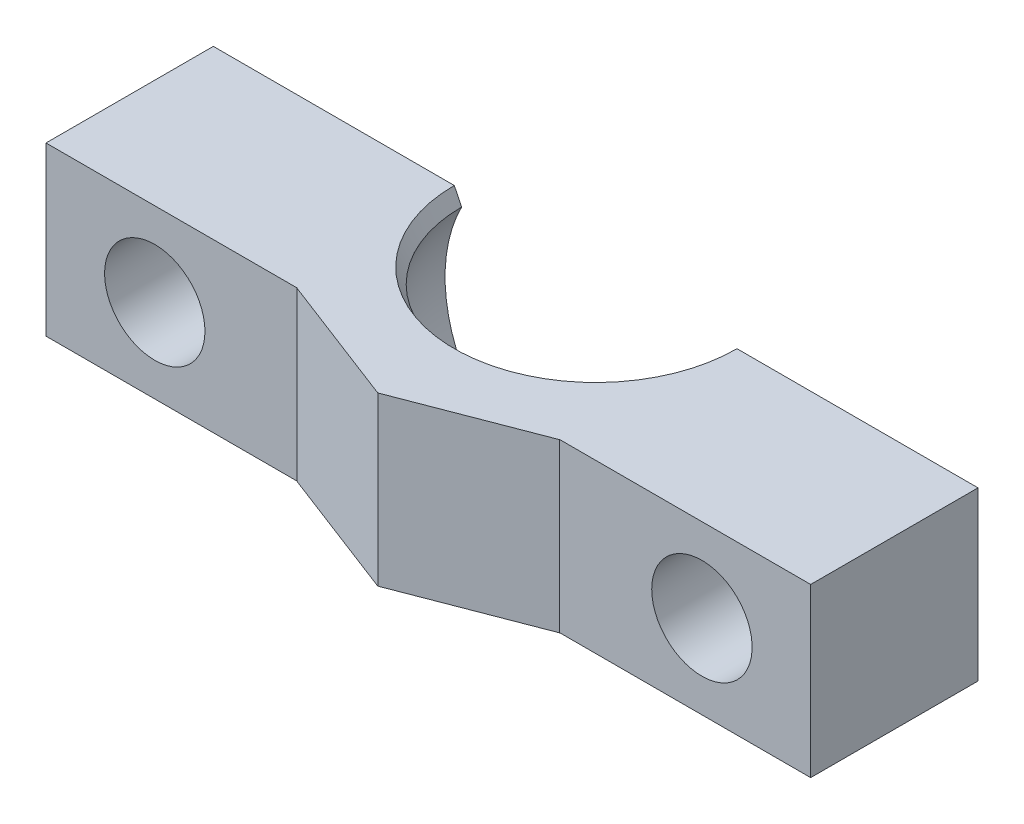
ISO-10303-21;
HEADER;
FILE_DESCRIPTION(('STEP AP214'),'2;1');
FILE_NAME('part.step','',(''),(''),'','','');
FILE_SCHEMA(('AUTOMOTIVE_DESIGN { 1 0 10303 214 1 1 1 1 }'));
ENDSEC;
DATA;
#1=APPLICATION_CONTEXT('core data for automotive mechanical design processes');
#2=APPLICATION_PROTOCOL_DEFINITION('international standard','automotive_design',2000,#1);
#3=PRODUCT_CONTEXT('',#1,'mechanical');
#4=PRODUCT('Part','Part','',(#3));
#5=PRODUCT_RELATED_PRODUCT_CATEGORY('part','',(#4));
#6=PRODUCT_DEFINITION_FORMATION('','',#4);
#7=PRODUCT_DEFINITION_CONTEXT('part definition',#1,'design');
#8=PRODUCT_DEFINITION('design','',#6,#7);
#9=PRODUCT_DEFINITION_SHAPE('','',#8);
#10=(LENGTH_UNIT() NAMED_UNIT(*) SI_UNIT(.MILLI.,.METRE.));
#11=(NAMED_UNIT(*) PLANE_ANGLE_UNIT() SI_UNIT($,.RADIAN.));
#12=(NAMED_UNIT(*) SI_UNIT($,.STERADIAN.) SOLID_ANGLE_UNIT());
#13=UNCERTAINTY_MEASURE_WITH_UNIT(LENGTH_MEASURE(1.E-05),#10,'distance_accuracy_value','');
#14=(GEOMETRIC_REPRESENTATION_CONTEXT(3) GLOBAL_UNCERTAINTY_ASSIGNED_CONTEXT((#13)) GLOBAL_UNIT_ASSIGNED_CONTEXT((#10,
#11,#12)) REPRESENTATION_CONTEXT('',''));
#15=CARTESIAN_POINT('',(0.,0.,0.));
#16=DIRECTION('',(0.,0.,1.));
#17=DIRECTION('',(1.,0.,0.));
#18=AXIS2_PLACEMENT_3D('',#15,#16,#17);
#19=CARTESIAN_POINT('',(-45.7,10.,0.));
#20=DIRECTION('',(1.,0.,0.));
#21=DIRECTION('',(0.,0.,-1.));
#22=AXIS2_PLACEMENT_3D('',#19,#20,#21);
#23=PLANE('',#22);
#24=DIRECTION('',(0.,-1.,0.));
#25=VECTOR('',#24,1.);
#26=CARTESIAN_POINT('',(-45.7,10.,10.));
#27=LINE('',#26,#25);
#28=CARTESIAN_POINT('',(-45.7,10.,10.));
#29=VERTEX_POINT('',#28);
#30=CARTESIAN_POINT('',(-45.7,0.,10.));
#31=VERTEX_POINT('',#30);
#32=EDGE_CURVE('E156',#29,#31,#27,.T.);
#33=ORIENTED_EDGE('',*,*,#32,.F.);
#34=DIRECTION('',(0.,0.,1.));
#35=VECTOR('',#34,1.);
#36=CARTESIAN_POINT('',(-45.7,10.,0.));
#37=LINE('',#36,#35);
#38=CARTESIAN_POINT('',(-45.7,10.,0.));
#39=VERTEX_POINT('',#38);
#40=EDGE_CURVE('E202',#39,#29,#37,.T.);
#41=ORIENTED_EDGE('',*,*,#40,.F.);
#42=DIRECTION('',(0.,-1.,0.));
#43=VECTOR('',#42,1.);
#44=CARTESIAN_POINT('',(-45.7,10.,0.));
#45=LINE('',#44,#43);
#46=CARTESIAN_POINT('',(-45.7,0.,0.));
#47=VERTEX_POINT('',#46);
#48=EDGE_CURVE('E205',#39,#47,#45,.T.);
#49=ORIENTED_EDGE('',*,*,#48,.T.);
#50=DIRECTION('',(0.,0.,1.));
#51=VECTOR('',#50,1.);
#52=CARTESIAN_POINT('',(-45.7,0.,0.));
#53=LINE('',#52,#51);
#54=EDGE_CURVE('E199',#47,#31,#53,.T.);
#55=ORIENTED_EDGE('',*,*,#54,.T.);
#56=EDGE_LOOP('',(#33,#41,#49,#55));
#57=FACE_BOUND('',#56,.T.);
#58=ADVANCED_FACE('F39',(#57),#23,.F.);
#59=CARTESIAN_POINT('',(-39.2,5.,15.));
#60=DIRECTION('',(0.,0.,-1.));
#61=DIRECTION('',(-1.,0.,0.));
#62=AXIS2_PLACEMENT_3D('',#59,#60,#61);
#63=CYLINDRICAL_SURFACE('',#62,3.);
#64=CARTESIAN_POINT('',(-39.2,5.,0.));
#65=DIRECTION('',(0.,0.,-1.));
#66=DIRECTION('',(-1.,0.,0.));
#67=AXIS2_PLACEMENT_3D('',#64,#65,#66);
#68=CIRCLE('',#67,3.);
#69=CARTESIAN_POINT('',(-42.2,5.,0.));
#70=VERTEX_POINT('',#69);
#71=EDGE_CURVE('E188',#70,#70,#68,.T.);
#72=ORIENTED_EDGE('',*,*,#71,.T.);
#73=EDGE_LOOP('',(#72));
#74=FACE_BOUND('',#73,.T.);
#75=CARTESIAN_POINT('',(-39.2,5.,10.));
#76=DIRECTION('',(0.,0.,1.));
#77=DIRECTION('',(1.,0.,0.));
#78=AXIS2_PLACEMENT_3D('',#75,#76,#77);
#79=CIRCLE('',#78,3.);
#80=CARTESIAN_POINT('',(-36.2,5.,10.));
#81=VERTEX_POINT('',#80);
#82=EDGE_CURVE('E191',#81,#81,#79,.F.);
#83=ORIENTED_EDGE('',*,*,#82,.F.);
#84=EDGE_LOOP('',(#83));
#85=FACE_BOUND('',#84,.T.);
#86=ADVANCED_FACE('F270',(#74,#85),#63,.F.);
#87=CARTESIAN_POINT('',(0.,10.,0.));
#88=DIRECTION('',(0.,0.,1.));
#89=DIRECTION('',(1.,0.,0.));
#90=AXIS2_PLACEMENT_3D('',#87,#88,#89);
#91=PLANE('',#90);
#92=ORIENTED_EDGE('',*,*,#71,.F.);
#93=EDGE_LOOP('',(#92));
#94=FACE_BOUND('',#93,.T.);
#95=CARTESIAN_POINT('',(-22.85,5.,0.));
#96=DIRECTION('',(0.,0.,1.));
#97=DIRECTION('',(1.,0.,0.));
#98=AXIS2_PLACEMENT_3D('',#95,#96,#97);
#99=CIRCLE('',#98,9.);
#100=CARTESIAN_POINT('',(-30.8584077140291,9.10675125687925,0.));
#101=VERTEX_POINT('',#100);
#102=CARTESIAN_POINT('',(-30.8584077140291,0.893248743120768,0.));
#103=VERTEX_POINT('',#102);
#104=EDGE_CURVE('E192',#101,#103,#99,.T.);
#105=ORIENTED_EDGE('',*,*,#104,.T.);
#106=DIRECTION('',(-0.442304522045315,-0.896864933966239,0.));
#107=VECTOR('',#106,1.);
#108=CARTESIAN_POINT('',(-22.85,17.1319704781013,0.));
#109=LINE('',#108,#107);
#110=CARTESIAN_POINT('',(-31.2989288487404,0.,0.));
#111=VERTEX_POINT('',#110);
#112=EDGE_CURVE('E241',#103,#111,#109,.T.);
#113=ORIENTED_EDGE('',*,*,#112,.T.);
#114=DIRECTION('',(-1.,0.,0.));
#115=VECTOR('',#114,1.);
#116=CARTESIAN_POINT('',(0.,0.,0.));
#117=LINE('',#116,#115);
#118=EDGE_CURVE('E207',#111,#47,#117,.T.);
#119=ORIENTED_EDGE('',*,*,#118,.T.);
#120=ORIENTED_EDGE('',*,*,#48,.F.);
#121=DIRECTION('',(-1.,0.,0.));
#122=VECTOR('',#121,1.);
#123=CARTESIAN_POINT('',(0.,10.,0.));
#124=LINE('',#123,#122);
#125=CARTESIAN_POINT('',(-31.2989288487404,10.,0.));
#126=VERTEX_POINT('',#125);
#127=EDGE_CURVE('E198',#126,#39,#124,.T.);
#128=ORIENTED_EDGE('',*,*,#127,.F.);
#129=DIRECTION('',(0.442304522045323,-0.896864933966235,0.));
#130=VECTOR('',#129,1.);
#131=CARTESIAN_POINT('',(-22.85,-7.13197047810091,0.));
#132=LINE('',#131,#130);
#133=EDGE_CURVE('E239',#126,#101,#132,.T.);
#134=ORIENTED_EDGE('',*,*,#133,.T.);
#135=EDGE_LOOP('',(#105,#113,#119,#120,#128,#134));
#136=FACE_BOUND('',#135,.T.);
#137=ADVANCED_FACE('F255',(#94,#136),#91,.F.);
#138=CARTESIAN_POINT('',(0.,10.,0.));
#139=DIRECTION('',(-1.,0.,0.));
#140=DIRECTION('',(0.,0.,1.));
#141=AXIS2_PLACEMENT_3D('',#138,#139,#140);
#142=PLANE('',#141);
#143=DIRECTION('',(0.,0.,-1.));
#144=VECTOR('',#143,1.);
#145=CARTESIAN_POINT('',(0.,10.,0.));
#146=LINE('',#145,#144);
#147=CARTESIAN_POINT('',(0.,10.,10.));
#148=VERTEX_POINT('',#147);
#149=CARTESIAN_POINT('',(0.,10.,0.));
#150=VERTEX_POINT('',#149);
#151=EDGE_CURVE('E196',#148,#150,#146,.T.);
#152=ORIENTED_EDGE('',*,*,#151,.F.);
#153=DIRECTION('',(0.,1.,0.));
#154=VECTOR('',#153,1.);
#155=CARTESIAN_POINT('',(0.,10.,10.));
#156=LINE('',#155,#154);
#157=CARTESIAN_POINT('',(0.,0.,10.));
#158=VERTEX_POINT('',#157);
#159=EDGE_CURVE('E168',#158,#148,#156,.T.);
#160=ORIENTED_EDGE('',*,*,#159,.F.);
#161=DIRECTION('',(0.,0.,-1.));
#162=VECTOR('',#161,1.);
#163=CARTESIAN_POINT('',(0.,0.,0.));
#164=LINE('',#163,#162);
#165=CARTESIAN_POINT('',(0.,0.,0.));
#166=VERTEX_POINT('',#165);
#167=EDGE_CURVE('E195',#158,#166,#164,.T.);
#168=ORIENTED_EDGE('',*,*,#167,.T.);
#169=DIRECTION('',(0.,-1.,0.));
#170=VECTOR('',#169,1.);
#171=CARTESIAN_POINT('',(0.,10.,0.));
#172=LINE('',#171,#170);
#173=EDGE_CURVE('E213',#150,#166,#172,.T.);
#174=ORIENTED_EDGE('',*,*,#173,.F.);
#175=EDGE_LOOP('',(#152,#160,#168,#174));
#176=FACE_BOUND('',#175,.T.);
#177=ADVANCED_FACE('F282',(#176),#142,.F.);
#178=CARTESIAN_POINT('',(-6.5,5.,0.));
#179=DIRECTION('',(0.,0.,-1.));
#180=DIRECTION('',(-1.,0.,0.));
#181=AXIS2_PLACEMENT_3D('',#178,#179,#180);
#182=CIRCLE('',#181,3.);
#183=CARTESIAN_POINT('',(-9.5,5.,0.));
#184=VERTEX_POINT('',#183);
#185=EDGE_CURVE('E184',#184,#184,#182,.T.);
#186=ORIENTED_EDGE('',*,*,#185,.F.);
#187=EDGE_LOOP('',(#186));
#188=FACE_BOUND('',#187,.T.);
#189=CARTESIAN_POINT('',(-14.4010711512596,0.,0.));
#190=VERTEX_POINT('',#189);
#191=EDGE_CURVE('E208',#166,#190,#117,.T.);
#192=ORIENTED_EDGE('',*,*,#191,.T.);
#193=DIRECTION('',(-0.442304522045315,0.896864933966239,0.));
#194=VECTOR('',#193,1.);
#195=CARTESIAN_POINT('',(-22.85,17.1319704781013,0.));
#196=LINE('',#195,#194);
#197=CARTESIAN_POINT('',(-14.8415922859709,0.893248743120767,0.));
#198=VERTEX_POINT('',#197);
#199=EDGE_CURVE('E48',#190,#198,#196,.T.);
#200=ORIENTED_EDGE('',*,*,#199,.T.);
#201=CARTESIAN_POINT('',(-14.8415922859709,9.10675125687925,0.));
#202=VERTEX_POINT('',#201);
#203=EDGE_CURVE('E187',#198,#202,#99,.T.);
#204=ORIENTED_EDGE('',*,*,#203,.T.);
#205=DIRECTION('',(0.442304522045323,0.896864933966235,0.));
#206=VECTOR('',#205,1.);
#207=CARTESIAN_POINT('',(-22.85,-7.13197047810091,0.));
#208=LINE('',#207,#206);
#209=CARTESIAN_POINT('',(-14.4010711512596,10.,0.));
#210=VERTEX_POINT('',#209);
#211=EDGE_CURVE('E55',#202,#210,#208,.T.);
#212=ORIENTED_EDGE('',*,*,#211,.T.);
#213=EDGE_CURVE('E200',#150,#210,#124,.T.);
#214=ORIENTED_EDGE('',*,*,#213,.F.);
#215=ORIENTED_EDGE('',*,*,#173,.T.);
#216=EDGE_LOOP('',(#192,#200,#204,#212,#214,#215));
#217=FACE_BOUND('',#216,.T.);
#218=ADVANCED_FACE('F246',(#188,#217),#91,.F.);
#219=CARTESIAN_POINT('',(0.,10.,0.));
#220=DIRECTION('',(0.,-1.,0.));
#221=DIRECTION('',(0.,0.,-1.));
#222=AXIS2_PLACEMENT_3D('',#219,#220,#221);
#223=PLANE('',#222);
#224=ORIENTED_EDGE('',*,*,#213,.T.);
#225=CARTESIAN_POINT('',(-22.85,10.,0.));
#226=DIRECTION('',(0.,-1.,0.));
#227=DIRECTION('',(0.,0.,-1.));
#228=AXIS2_PLACEMENT_3D('',#225,#226,#227);
#229=CIRCLE('',#228,8.44892884874043);
#230=EDGE_CURVE('E11',#210,#126,#229,.T.);
#231=ORIENTED_EDGE('',*,*,#230,.T.);
#232=ORIENTED_EDGE('',*,*,#127,.T.);
#233=ORIENTED_EDGE('',*,*,#40,.T.);
#234=DIRECTION('',(-1.,0.,0.));
#235=VECTOR('',#234,1.);
#236=CARTESIAN_POINT('',(-45.7,10.,10.));
#237=LINE('',#236,#235);
#238=CARTESIAN_POINT('',(-30.7,10.,10.));
#239=VERTEX_POINT('',#238);
#240=EDGE_CURVE('E149',#239,#29,#237,.T.);
#241=ORIENTED_EDGE('',*,*,#240,.F.);
#242=DIRECTION('',(0.,0.,1.));
#243=VECTOR('',#242,1.);
#244=CARTESIAN_POINT('',(-30.7,10.,10.));
#245=LINE('',#244,#243);
#246=CARTESIAN_POINT('',(-30.7,10.,10.0097675445396));
#247=VERTEX_POINT('',#246);
#248=EDGE_CURVE('E146',#239,#247,#245,.T.);
#249=ORIENTED_EDGE('',*,*,#248,.T.);
#250=DIRECTION('',(-0.933580426497202,0.,-0.358367949545299));
#251=VECTOR('',#250,1.);
#252=CARTESIAN_POINT('',(-30.7,10.,10.0097675445396));
#253=LINE('',#252,#251);
#254=CARTESIAN_POINT('',(-22.85,10.,13.0231002195676));
#255=VERTEX_POINT('',#254);
#256=EDGE_CURVE('E226',#247,#255,#253,.F.);
#257=ORIENTED_EDGE('',*,*,#256,.T.);
#258=DIRECTION('',(-0.933580426497202,0.,0.358367949545299));
#259=VECTOR('',#258,1.);
#260=CARTESIAN_POINT('',(-15.,10.,10.0097675445396));
#261=LINE('',#260,#259);
#262=CARTESIAN_POINT('',(-15.,10.,10.0097675445396));
#263=VERTEX_POINT('',#262);
#264=EDGE_CURVE('E228',#255,#263,#261,.F.);
#265=ORIENTED_EDGE('',*,*,#264,.T.);
#266=DIRECTION('',(0.,0.,1.));
#267=VECTOR('',#266,1.);
#268=CARTESIAN_POINT('',(-15.,10.,10.));
#269=LINE('',#268,#267);
#270=CARTESIAN_POINT('',(-15.,10.,10.));
#271=VERTEX_POINT('',#270);
#272=EDGE_CURVE('E178',#271,#263,#269,.T.);
#273=ORIENTED_EDGE('',*,*,#272,.F.);
#274=DIRECTION('',(-1.,0.,0.));
#275=VECTOR('',#274,1.);
#276=CARTESIAN_POINT('',(0.,10.,10.));
#277=LINE('',#276,#275);
#278=EDGE_CURVE('E170',#148,#271,#277,.T.);
#279=ORIENTED_EDGE('',*,*,#278,.F.);
#280=ORIENTED_EDGE('',*,*,#151,.T.);
#281=EDGE_LOOP('',(#224,#231,#232,#233,#241,#249,#257,#265,#273,#279,#280));
#282=FACE_BOUND('',#281,.T.);
#283=ADVANCED_FACE('F261',(#282),#223,.F.);
#284=CARTESIAN_POINT('',(0.,0.,0.));
#285=DIRECTION('',(0.,-1.,0.));
#286=DIRECTION('',(0.,0.,-1.));
#287=AXIS2_PLACEMENT_3D('',#284,#285,#286);
#288=PLANE('',#287);
#289=ORIENTED_EDGE('',*,*,#118,.F.);
#290=CARTESIAN_POINT('',(-22.85,0.,0.));
#291=DIRECTION('',(0.,-1.,0.));
#292=DIRECTION('',(0.,0.,-1.));
#293=AXIS2_PLACEMENT_3D('',#290,#291,#292);
#294=CIRCLE('',#293,8.44892884874043);
#295=EDGE_CURVE('E63',#111,#190,#294,.F.);
#296=ORIENTED_EDGE('',*,*,#295,.T.);
#297=ORIENTED_EDGE('',*,*,#191,.F.);
#298=ORIENTED_EDGE('',*,*,#167,.F.);
#299=DIRECTION('',(1.,0.,0.));
#300=VECTOR('',#299,1.);
#301=CARTESIAN_POINT('',(0.,0.,10.));
#302=LINE('',#301,#300);
#303=CARTESIAN_POINT('',(-15.,0.,10.));
#304=VERTEX_POINT('',#303);
#305=EDGE_CURVE('E176',#304,#158,#302,.T.);
#306=ORIENTED_EDGE('',*,*,#305,.F.);
#307=DIRECTION('',(0.,0.,1.));
#308=VECTOR('',#307,1.);
#309=CARTESIAN_POINT('',(-15.,0.,10.));
#310=LINE('',#309,#308);
#311=CARTESIAN_POINT('',(-15.,0.,10.0097675445396));
#312=VERTEX_POINT('',#311);
#313=EDGE_CURVE('E179',#304,#312,#310,.T.);
#314=ORIENTED_EDGE('',*,*,#313,.T.);
#315=DIRECTION('',(0.933580426497202,0.,-0.358367949545299));
#316=VECTOR('',#315,1.);
#317=CARTESIAN_POINT('',(1.42250710437495,0.,3.70575770205644));
#318=LINE('',#317,#316);
#319=CARTESIAN_POINT('',(-22.85,0.,13.0231002195676));
#320=VERTEX_POINT('',#319);
#321=EDGE_CURVE('E224',#312,#320,#318,.F.);
#322=ORIENTED_EDGE('',*,*,#321,.T.);
#323=DIRECTION('',(0.933580426497202,0.,0.358367949545299));
#324=VECTOR('',#323,1.);
#325=CARTESIAN_POINT('',(-7.29164784221645,0.,18.9953920573563));
#326=LINE('',#325,#324);
#327=CARTESIAN_POINT('',(-30.7,0.,10.0097675445396));
#328=VERTEX_POINT('',#327);
#329=EDGE_CURVE('E162',#320,#328,#326,.F.);
#330=ORIENTED_EDGE('',*,*,#329,.T.);
#331=DIRECTION('',(0.,0.,1.));
#332=VECTOR('',#331,1.);
#333=CARTESIAN_POINT('',(-30.7,0.,10.));
#334=LINE('',#333,#332);
#335=CARTESIAN_POINT('',(-30.7,0.,10.));
#336=VERTEX_POINT('',#335);
#337=EDGE_CURVE('E143',#336,#328,#334,.T.);
#338=ORIENTED_EDGE('',*,*,#337,.F.);
#339=DIRECTION('',(1.,0.,0.));
#340=VECTOR('',#339,1.);
#341=CARTESIAN_POINT('',(-45.7,0.,10.));
#342=LINE('',#341,#340);
#343=EDGE_CURVE('E150',#31,#336,#342,.T.);
#344=ORIENTED_EDGE('',*,*,#343,.F.);
#345=ORIENTED_EDGE('',*,*,#54,.F.);
#346=EDGE_LOOP('',(#289,#296,#297,#298,#306,#314,#322,#330,#338,#344,#345));
#347=FACE_BOUND('',#346,.T.);
#348=ADVANCED_FACE('F160',(#347),#288,.T.);
#349=CARTESIAN_POINT('',(-22.85,5.,0.));
#350=DIRECTION('',(0.,1.,0.));
#351=DIRECTION('',(1.,0.,0.));
#352=AXIS2_PLACEMENT_3D('',#349,#350,#351);
#353=SPHERICAL_SURFACE('',#352,9.);
#354=ORIENTED_EDGE('',*,*,#203,.F.);
#355=CARTESIAN_POINT('',(-22.85,0.893248743120766,0.));
#356=DIRECTION('',(0.,1.,0.));
#357=DIRECTION('',(0.,0.,1.));
#358=AXIS2_PLACEMENT_3D('',#355,#356,#357);
#359=CIRCLE('',#358,8.0084077140291);
#360=EDGE_CURVE('E236',#198,#103,#359,.F.);
#361=ORIENTED_EDGE('',*,*,#360,.T.);
#362=ORIENTED_EDGE('',*,*,#104,.F.);
#363=CARTESIAN_POINT('',(-22.85,9.10675125687925,0.));
#364=DIRECTION('',(0.,-1.,0.));
#365=DIRECTION('',(0.,0.,-1.));
#366=AXIS2_PLACEMENT_3D('',#363,#364,#365);
#367=CIRCLE('',#366,8.0084077140291);
#368=EDGE_CURVE('E232',#101,#202,#367,.F.);
#369=ORIENTED_EDGE('',*,*,#368,.T.);
#370=EDGE_LOOP('',(#354,#361,#362,#369));
#371=FACE_BOUND('',#370,.T.);
#372=ADVANCED_FACE('F250',(#371),#353,.F.);
#373=CARTESIAN_POINT('',(-6.5,5.,15.));
#374=DIRECTION('',(0.,0.,-1.));
#375=DIRECTION('',(-1.,0.,0.));
#376=AXIS2_PLACEMENT_3D('',#373,#374,#375);
#377=CYLINDRICAL_SURFACE('',#376,3.);
#378=CARTESIAN_POINT('',(-6.5,5.,10.));
#379=DIRECTION('',(0.,0.,-1.));
#380=DIRECTION('',(-1.,0.,0.));
#381=AXIS2_PLACEMENT_3D('',#378,#379,#380);
#382=CIRCLE('',#381,3.);
#383=CARTESIAN_POINT('',(-9.5,5.,10.));
#384=VERTEX_POINT('',#383);
#385=EDGE_CURVE('E164',#384,#384,#382,.F.);
#386=ORIENTED_EDGE('',*,*,#385,.T.);
#387=EDGE_LOOP('',(#386));
#388=FACE_BOUND('',#387,.T.);
#389=ORIENTED_EDGE('',*,*,#185,.T.);
#390=EDGE_LOOP('',(#389));
#391=FACE_BOUND('',#390,.T.);
#392=ADVANCED_FACE('F326',(#388,#391),#377,.F.);
#393=CARTESIAN_POINT('',(0.,0.,10.));
#394=DIRECTION('',(0.,0.,-1.));
#395=DIRECTION('',(-1.,0.,0.));
#396=AXIS2_PLACEMENT_3D('',#393,#394,#395);
#397=PLANE('',#396);
#398=ORIENTED_EDGE('',*,*,#159,.T.);
#399=ORIENTED_EDGE('',*,*,#278,.T.);
#400=DIRECTION('',(0.,-1.,0.));
#401=VECTOR('',#400,1.);
#402=CARTESIAN_POINT('',(-15.,10.,10.));
#403=LINE('',#402,#401);
#404=EDGE_CURVE('E174',#271,#304,#403,.T.);
#405=ORIENTED_EDGE('',*,*,#404,.T.);
#406=ORIENTED_EDGE('',*,*,#305,.T.);
#407=EDGE_LOOP('',(#398,#399,#405,#406));
#408=FACE_BOUND('',#407,.T.);
#409=ORIENTED_EDGE('',*,*,#385,.F.);
#410=EDGE_LOOP('',(#409));
#411=FACE_BOUND('',#410,.T.);
#412=ADVANCED_FACE('F319',(#408,#411),#397,.F.);
#413=CARTESIAN_POINT('',(-15.,10.,10.));
#414=DIRECTION('',(-1.,0.,0.));
#415=DIRECTION('',(0.,-1.,0.));
#416=AXIS2_PLACEMENT_3D('',#413,#414,#415);
#417=PLANE('',#416);
#418=ORIENTED_EDGE('',*,*,#272,.T.);
#419=DIRECTION('',(0.,-1.,0.));
#420=VECTOR('',#419,1.);
#421=CARTESIAN_POINT('',(-15.,10.,10.0097675445396));
#422=LINE('',#421,#420);
#423=EDGE_CURVE('E216',#263,#312,#422,.T.);
#424=ORIENTED_EDGE('',*,*,#423,.T.);
#425=ORIENTED_EDGE('',*,*,#313,.F.);
#426=ORIENTED_EDGE('',*,*,#404,.F.);
#427=EDGE_LOOP('',(#418,#424,#425,#426));
#428=FACE_BOUND('',#427,.T.);
#429=ADVANCED_FACE('F315',(#428),#417,.F.);
#430=CARTESIAN_POINT('',(0.,0.,10.));
#431=DIRECTION('',(0.,0.,1.));
#432=DIRECTION('',(1.,0.,0.));
#433=AXIS2_PLACEMENT_3D('',#430,#431,#432);
#434=PLANE('',#433);
#435=ORIENTED_EDGE('',*,*,#32,.T.);
#436=ORIENTED_EDGE('',*,*,#343,.T.);
#437=DIRECTION('',(0.,1.,0.));
#438=VECTOR('',#437,1.);
#439=CARTESIAN_POINT('',(-30.7,10.,10.));
#440=LINE('',#439,#438);
#441=EDGE_CURVE('E139',#336,#239,#440,.T.);
#442=ORIENTED_EDGE('',*,*,#441,.T.);
#443=ORIENTED_EDGE('',*,*,#240,.T.);
#444=EDGE_LOOP('',(#435,#436,#442,#443));
#445=FACE_BOUND('',#444,.T.);
#446=ORIENTED_EDGE('',*,*,#82,.T.);
#447=EDGE_LOOP('',(#446));
#448=FACE_BOUND('',#447,.T.);
#449=ADVANCED_FACE('F153',(#445,#448),#434,.T.);
#450=CARTESIAN_POINT('',(-30.7,10.,10.));
#451=DIRECTION('',(1.,0.,0.));
#452=DIRECTION('',(0.,0.,-1.));
#453=AXIS2_PLACEMENT_3D('',#450,#451,#452);
#454=PLANE('',#453);
#455=ORIENTED_EDGE('',*,*,#337,.T.);
#456=DIRECTION('',(0.,1.,0.));
#457=VECTOR('',#456,1.);
#458=CARTESIAN_POINT('',(-30.7,10.,10.0097675445396));
#459=LINE('',#458,#457);
#460=EDGE_CURVE('E230',#328,#247,#459,.T.);
#461=ORIENTED_EDGE('',*,*,#460,.T.);
#462=ORIENTED_EDGE('',*,*,#248,.F.);
#463=ORIENTED_EDGE('',*,*,#441,.F.);
#464=EDGE_LOOP('',(#455,#461,#462,#463));
#465=FACE_BOUND('',#464,.T.);
#466=ADVANCED_FACE('F141',(#465),#454,.F.);
#467=CARTESIAN_POINT('',(-30.7,10.,10.0097675445396));
#468=DIRECTION('',(0.358367949545299,0.,-0.933580426497202));
#469=DIRECTION('',(0.,1.,0.));
#470=AXIS2_PLACEMENT_3D('',#467,#468,#469);
#471=PLANE('',#470);
#472=DIRECTION('',(0.,-1.,0.));
#473=VECTOR('',#472,1.);
#474=CARTESIAN_POINT('',(-22.85,10.,13.0231002195676));
#475=LINE('',#474,#473);
#476=EDGE_CURVE('E171',#255,#320,#475,.T.);
#477=ORIENTED_EDGE('',*,*,#476,.F.);
#478=ORIENTED_EDGE('',*,*,#256,.F.);
#479=ORIENTED_EDGE('',*,*,#460,.F.);
#480=ORIENTED_EDGE('',*,*,#329,.F.);
#481=EDGE_LOOP('',(#477,#478,#479,#480));
#482=FACE_BOUND('',#481,.T.);
#483=ADVANCED_FACE('F294',(#482),#471,.F.);
#484=CARTESIAN_POINT('',(-15.,10.,10.0097675445396));
#485=DIRECTION('',(-0.358367949545299,0.,-0.933580426497202));
#486=DIRECTION('',(0.,-1.,0.));
#487=AXIS2_PLACEMENT_3D('',#484,#485,#486);
#488=PLANE('',#487);
#489=ORIENTED_EDGE('',*,*,#264,.F.);
#490=ORIENTED_EDGE('',*,*,#476,.T.);
#491=ORIENTED_EDGE('',*,*,#321,.F.);
#492=ORIENTED_EDGE('',*,*,#423,.F.);
#493=EDGE_LOOP('',(#489,#490,#491,#492));
#494=FACE_BOUND('',#493,.T.);
#495=ADVANCED_FACE('F268',(#494),#488,.F.);
#496=CARTESIAN_POINT('',(-22.85,0.893248743120768,0.));
#497=DIRECTION('',(0.,-1.,0.));
#498=DIRECTION('',(0.,0.,-1.));
#499=AXIS2_PLACEMENT_3D('',#496,#497,#498);
#500=CONICAL_SURFACE('',#499,8.0084077140291,0.45816658098032);
#501=ORIENTED_EDGE('',*,*,#199,.F.);
#502=ORIENTED_EDGE('',*,*,#295,.F.);
#503=ORIENTED_EDGE('',*,*,#112,.F.);
#504=ORIENTED_EDGE('',*,*,#360,.F.);
#505=EDGE_LOOP('',(#501,#502,#503,#504));
#506=FACE_BOUND('',#505,.T.);
#507=ADVANCED_FACE('F253',(#506),#500,.F.);
#508=CARTESIAN_POINT('',(-22.85,10.,0.));
#509=DIRECTION('',(0.,1.,0.));
#510=DIRECTION('',(0.,0.,1.));
#511=AXIS2_PLACEMENT_3D('',#508,#509,#510);
#512=CONICAL_SURFACE('',#511,8.44892884874043,0.458166580980329);
#513=ORIENTED_EDGE('',*,*,#211,.F.);
#514=ORIENTED_EDGE('',*,*,#368,.F.);
#515=ORIENTED_EDGE('',*,*,#133,.F.);
#516=ORIENTED_EDGE('',*,*,#230,.F.);
#517=EDGE_LOOP('',(#513,#514,#515,#516));
#518=FACE_BOUND('',#517,.T.);
#519=ADVANCED_FACE('F42',(#518),#512,.F.);
#520=CLOSED_SHELL('',(#58,#86,#137,#177,#218,#283,#348,#372,#392,#412,#429,#449,#466,#483,#495,
#507,#519));
#521=MANIFOLD_SOLID_BREP('B2',#520);
#522=ADVANCED_BREP_SHAPE_REPRESENTATION('',(#18,#521),#14);
#523=SHAPE_DEFINITION_REPRESENTATION(#9,#522);
ENDSEC;
END-ISO-10303-21;
